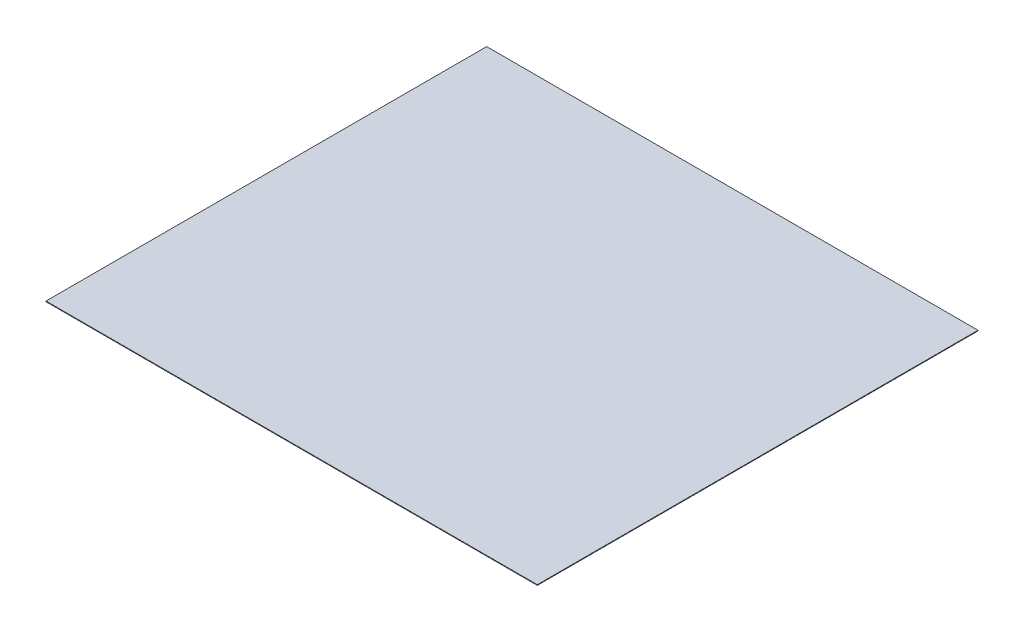
ISO-10303-21;
HEADER;
FILE_DESCRIPTION(('STEP AP214'),'2;1');
FILE_NAME('part.step','',(''),(''),'','','');
FILE_SCHEMA(('AUTOMOTIVE_DESIGN { 1 0 10303 214 1 1 1 1 }'));
ENDSEC;
DATA;
#1=APPLICATION_CONTEXT('core data for automotive mechanical design processes');
#2=APPLICATION_PROTOCOL_DEFINITION('international standard','automotive_design',2000,#1);
#3=PRODUCT_CONTEXT('',#1,'mechanical');
#4=PRODUCT('Part','Part','',(#3));
#5=PRODUCT_RELATED_PRODUCT_CATEGORY('part','',(#4));
#6=PRODUCT_DEFINITION_FORMATION('','',#4);
#7=PRODUCT_DEFINITION_CONTEXT('part definition',#1,'design');
#8=PRODUCT_DEFINITION('design','',#6,#7);
#9=PRODUCT_DEFINITION_SHAPE('','',#8);
#10=(LENGTH_UNIT() NAMED_UNIT(*) SI_UNIT(.MILLI.,.METRE.));
#11=(NAMED_UNIT(*) PLANE_ANGLE_UNIT() SI_UNIT($,.RADIAN.));
#12=(NAMED_UNIT(*) SI_UNIT($,.STERADIAN.) SOLID_ANGLE_UNIT());
#13=UNCERTAINTY_MEASURE_WITH_UNIT(LENGTH_MEASURE(1.E-05),#10,'distance_accuracy_value','');
#14=(GEOMETRIC_REPRESENTATION_CONTEXT(3) GLOBAL_UNCERTAINTY_ASSIGNED_CONTEXT((#13)) GLOBAL_UNIT_ASSIGNED_CONTEXT((#10,
#11,#12)) REPRESENTATION_CONTEXT('',''));
#15=CARTESIAN_POINT('',(0.,0.,0.));
#16=DIRECTION('',(0.,0.,1.));
#17=DIRECTION('',(1.,0.,0.));
#18=AXIS2_PLACEMENT_3D('',#15,#16,#17);
#19=CARTESIAN_POINT('',(3902.,10.,3500.));
#20=DIRECTION('',(-1.,0.,0.));
#21=DIRECTION('',(0.,0.,1.));
#22=AXIS2_PLACEMENT_3D('',#19,#20,#21);
#23=PLANE('',#22);
#24=DIRECTION('',(0.,0.,-1.));
#25=VECTOR('',#24,1.);
#26=CARTESIAN_POINT('',(3902.,0.,3500.));
#27=LINE('',#26,#25);
#28=CARTESIAN_POINT('',(3902.,0.,3500.));
#29=VERTEX_POINT('',#28);
#30=CARTESIAN_POINT('',(3902.,0.,-3500.));
#31=VERTEX_POINT('',#30);
#32=EDGE_CURVE('E100',#29,#31,#27,.T.);
#33=ORIENTED_EDGE('',*,*,#32,.T.);
#34=DIRECTION('',(0.,-1.,0.));
#35=VECTOR('',#34,1.);
#36=CARTESIAN_POINT('',(3902.,10.,-3500.));
#37=LINE('',#36,#35);
#38=CARTESIAN_POINT('',(3902.,10.,-3500.));
#39=VERTEX_POINT('',#38);
#40=EDGE_CURVE('E11',#39,#31,#37,.T.);
#41=ORIENTED_EDGE('',*,*,#40,.F.);
#42=DIRECTION('',(0.,0.,-1.));
#43=VECTOR('',#42,1.);
#44=CARTESIAN_POINT('',(3902.,10.,3500.));
#45=LINE('',#44,#43);
#46=CARTESIAN_POINT('',(3902.,10.,3500.));
#47=VERTEX_POINT('',#46);
#48=EDGE_CURVE('E88',#47,#39,#45,.T.);
#49=ORIENTED_EDGE('',*,*,#48,.F.);
#50=DIRECTION('',(0.,-1.,0.));
#51=VECTOR('',#50,1.);
#52=CARTESIAN_POINT('',(3902.,10.,3500.));
#53=LINE('',#52,#51);
#54=EDGE_CURVE('E96',#47,#29,#53,.T.);
#55=ORIENTED_EDGE('',*,*,#54,.T.);
#56=EDGE_LOOP('',(#33,#41,#49,#55));
#57=FACE_BOUND('',#56,.T.);
#58=ADVANCED_FACE('F37',(#57),#23,.F.);
#59=CARTESIAN_POINT('',(-3902.,10.,-3500.));
#60=DIRECTION('',(0.,0.,1.));
#61=DIRECTION('',(1.,0.,0.));
#62=AXIS2_PLACEMENT_3D('',#59,#60,#61);
#63=PLANE('',#62);
#64=DIRECTION('',(-1.,0.,0.));
#65=VECTOR('',#64,1.);
#66=CARTESIAN_POINT('',(-3902.,0.,-3500.));
#67=LINE('',#66,#65);
#68=CARTESIAN_POINT('',(-3902.,0.,-3500.));
#69=VERTEX_POINT('',#68);
#70=EDGE_CURVE('E92',#31,#69,#67,.T.);
#71=ORIENTED_EDGE('',*,*,#70,.T.);
#72=DIRECTION('',(0.,-1.,0.));
#73=VECTOR('',#72,1.);
#74=CARTESIAN_POINT('',(-3902.,10.,-3500.));
#75=LINE('',#74,#73);
#76=CARTESIAN_POINT('',(-3902.,10.,-3500.));
#77=VERTEX_POINT('',#76);
#78=EDGE_CURVE('E45',#77,#69,#75,.T.);
#79=ORIENTED_EDGE('',*,*,#78,.F.);
#80=DIRECTION('',(-1.,0.,0.));
#81=VECTOR('',#80,1.);
#82=CARTESIAN_POINT('',(-3902.,10.,-3500.));
#83=LINE('',#82,#81);
#84=EDGE_CURVE('E83',#39,#77,#83,.T.);
#85=ORIENTED_EDGE('',*,*,#84,.F.);
#86=ORIENTED_EDGE('',*,*,#40,.T.);
#87=EDGE_LOOP('',(#71,#79,#85,#86));
#88=FACE_BOUND('',#87,.T.);
#89=ADVANCED_FACE('F91',(#88),#63,.F.);
#90=CARTESIAN_POINT('',(-3902.,10.,3500.));
#91=DIRECTION('',(1.,0.,0.));
#92=DIRECTION('',(0.,0.,-1.));
#93=AXIS2_PLACEMENT_3D('',#90,#91,#92);
#94=PLANE('',#93);
#95=DIRECTION('',(0.,0.,1.));
#96=VECTOR('',#95,1.);
#97=CARTESIAN_POINT('',(-3902.,0.,3500.));
#98=LINE('',#97,#96);
#99=CARTESIAN_POINT('',(-3902.,0.,3500.));
#100=VERTEX_POINT('',#99);
#101=EDGE_CURVE('E70',#69,#100,#98,.T.);
#102=ORIENTED_EDGE('',*,*,#101,.T.);
#103=DIRECTION('',(0.,-1.,0.));
#104=VECTOR('',#103,1.);
#105=CARTESIAN_POINT('',(-3902.,10.,3500.));
#106=LINE('',#105,#104);
#107=CARTESIAN_POINT('',(-3902.,10.,3500.));
#108=VERTEX_POINT('',#107);
#109=EDGE_CURVE('E93',#108,#100,#106,.T.);
#110=ORIENTED_EDGE('',*,*,#109,.F.);
#111=DIRECTION('',(0.,0.,1.));
#112=VECTOR('',#111,1.);
#113=CARTESIAN_POINT('',(-3902.,10.,3500.));
#114=LINE('',#113,#112);
#115=EDGE_CURVE('E86',#77,#108,#114,.T.);
#116=ORIENTED_EDGE('',*,*,#115,.F.);
#117=ORIENTED_EDGE('',*,*,#78,.T.);
#118=EDGE_LOOP('',(#102,#110,#116,#117));
#119=FACE_BOUND('',#118,.T.);
#120=ADVANCED_FACE('F94',(#119),#94,.F.);
#121=CARTESIAN_POINT('',(-3902.,10.,3500.));
#122=DIRECTION('',(0.,0.,-1.));
#123=DIRECTION('',(-1.,0.,0.));
#124=AXIS2_PLACEMENT_3D('',#121,#122,#123);
#125=PLANE('',#124);
#126=DIRECTION('',(1.,0.,0.));
#127=VECTOR('',#126,1.);
#128=CARTESIAN_POINT('',(-3902.,0.,3500.));
#129=LINE('',#128,#127);
#130=EDGE_CURVE('E76',#100,#29,#129,.T.);
#131=ORIENTED_EDGE('',*,*,#130,.T.);
#132=ORIENTED_EDGE('',*,*,#54,.F.);
#133=DIRECTION('',(1.,0.,0.));
#134=VECTOR('',#133,1.);
#135=CARTESIAN_POINT('',(-3902.,10.,3500.));
#136=LINE('',#135,#134);
#137=EDGE_CURVE('E53',#108,#47,#136,.T.);
#138=ORIENTED_EDGE('',*,*,#137,.F.);
#139=ORIENTED_EDGE('',*,*,#109,.T.);
#140=EDGE_LOOP('',(#131,#132,#138,#139));
#141=FACE_BOUND('',#140,.T.);
#142=ADVANCED_FACE('F107',(#141),#125,.F.);
#143=CARTESIAN_POINT('',(0.,10.,0.));
#144=DIRECTION('',(0.,-1.,0.));
#145=DIRECTION('',(0.,0.,-1.));
#146=AXIS2_PLACEMENT_3D('',#143,#144,#145);
#147=PLANE('',#146);
#148=ORIENTED_EDGE('',*,*,#48,.T.);
#149=ORIENTED_EDGE('',*,*,#84,.T.);
#150=ORIENTED_EDGE('',*,*,#115,.T.);
#151=ORIENTED_EDGE('',*,*,#137,.T.);
#152=EDGE_LOOP('',(#148,#149,#150,#151));
#153=FACE_BOUND('',#152,.T.);
#154=ADVANCED_FACE('F84',(#153),#147,.F.);
#155=CARTESIAN_POINT('',(0.,0.,0.));
#156=DIRECTION('',(0.,-1.,0.));
#157=DIRECTION('',(0.,0.,-1.));
#158=AXIS2_PLACEMENT_3D('',#155,#156,#157);
#159=PLANE('',#158);
#160=ORIENTED_EDGE('',*,*,#32,.F.);
#161=ORIENTED_EDGE('',*,*,#130,.F.);
#162=ORIENTED_EDGE('',*,*,#101,.F.);
#163=ORIENTED_EDGE('',*,*,#70,.F.);
#164=EDGE_LOOP('',(#160,#161,#162,#163));
#165=FACE_BOUND('',#164,.T.);
#166=ADVANCED_FACE('F110',(#165),#159,.T.);
#167=CLOSED_SHELL('',(#58,#89,#120,#142,#154,#166));
#168=MANIFOLD_SOLID_BREP('B2',#167);
#169=ADVANCED_BREP_SHAPE_REPRESENTATION('',(#18,#168),#14);
#170=SHAPE_DEFINITION_REPRESENTATION(#9,#169);
ENDSEC;
END-ISO-10303-21;
